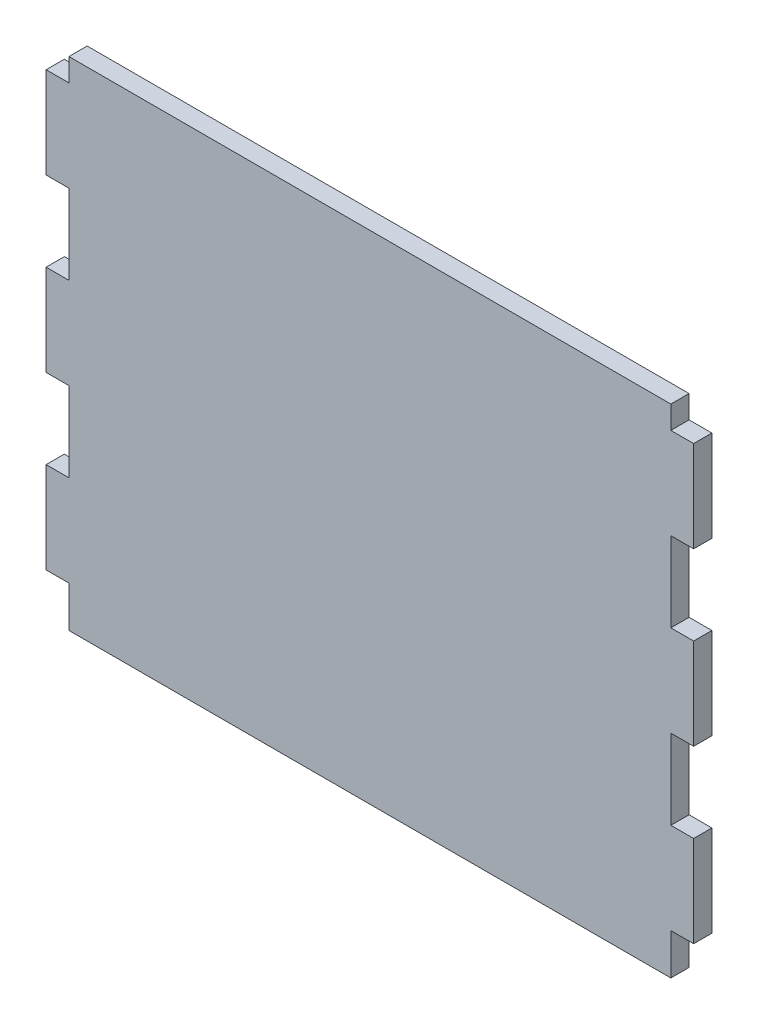
ISO-10303-21;
HEADER;
FILE_DESCRIPTION(('STEP AP214'),'2;1');
FILE_NAME('part.step','',(''),(''),'','','');
FILE_SCHEMA(('AUTOMOTIVE_DESIGN { 1 0 10303 214 1 1 1 1 }'));
ENDSEC;
DATA;
#1=APPLICATION_CONTEXT('core data for automotive mechanical design processes');
#2=APPLICATION_PROTOCOL_DEFINITION('international standard','automotive_design',2000,#1);
#3=PRODUCT_CONTEXT('',#1,'mechanical');
#4=PRODUCT('Part','Part','',(#3));
#5=PRODUCT_RELATED_PRODUCT_CATEGORY('part','',(#4));
#6=PRODUCT_DEFINITION_FORMATION('','',#4);
#7=PRODUCT_DEFINITION_CONTEXT('part definition',#1,'design');
#8=PRODUCT_DEFINITION('design','',#6,#7);
#9=PRODUCT_DEFINITION_SHAPE('','',#8);
#10=(LENGTH_UNIT() NAMED_UNIT(*) SI_UNIT(.MILLI.,.METRE.));
#11=(NAMED_UNIT(*) PLANE_ANGLE_UNIT() SI_UNIT($,.RADIAN.));
#12=(NAMED_UNIT(*) SI_UNIT($,.STERADIAN.) SOLID_ANGLE_UNIT());
#13=UNCERTAINTY_MEASURE_WITH_UNIT(LENGTH_MEASURE(1.E-05),#10,'distance_accuracy_value','');
#14=(GEOMETRIC_REPRESENTATION_CONTEXT(3) GLOBAL_UNCERTAINTY_ASSIGNED_CONTEXT((#13)) GLOBAL_UNIT_ASSIGNED_CONTEXT((#10,
#11,#12)) REPRESENTATION_CONTEXT('',''));
#15=CARTESIAN_POINT('',(0.,0.,0.));
#16=DIRECTION('',(0.,0.,1.));
#17=DIRECTION('',(1.,0.,0.));
#18=AXIS2_PLACEMENT_3D('',#15,#16,#17);
#19=CARTESIAN_POINT('',(-83.82,62.865,5.08));
#20=DIRECTION('',(1.,0.,0.));
#21=DIRECTION('',(0.,0.,-1.));
#22=AXIS2_PLACEMENT_3D('',#19,#20,#21);
#23=PLANE('',#22);
#24=DIRECTION('',(0.,-1.,0.));
#25=VECTOR('',#24,1.);
#26=CARTESIAN_POINT('',(-83.82,62.865,0.));
#27=LINE('',#26,#25);
#28=CARTESIAN_POINT('',(-83.82,69.215,0.));
#29=VERTEX_POINT('',#28);
#30=CARTESIAN_POINT('',(-83.82,62.865,0.));
#31=VERTEX_POINT('',#30);
#32=EDGE_CURVE('E260',#29,#31,#27,.T.);
#33=ORIENTED_EDGE('',*,*,#32,.T.);
#34=DIRECTION('',(0.,0.,-1.));
#35=VECTOR('',#34,1.);
#36=CARTESIAN_POINT('',(-83.82,62.865,5.08));
#37=LINE('',#36,#35);
#38=CARTESIAN_POINT('',(-83.82,62.865,5.08));
#39=VERTEX_POINT('',#38);
#40=EDGE_CURVE('E11',#39,#31,#37,.T.);
#41=ORIENTED_EDGE('',*,*,#40,.F.);
#42=DIRECTION('',(0.,-1.,0.));
#43=VECTOR('',#42,1.);
#44=CARTESIAN_POINT('',(-83.82,62.865,5.08));
#45=LINE('',#44,#43);
#46=CARTESIAN_POINT('',(-83.82,69.215,5.08));
#47=VERTEX_POINT('',#46);
#48=EDGE_CURVE('E342',#47,#39,#45,.T.);
#49=ORIENTED_EDGE('',*,*,#48,.F.);
#50=DIRECTION('',(0.,0.,-1.));
#51=VECTOR('',#50,1.);
#52=CARTESIAN_POINT('',(-83.82,69.215,5.08));
#53=LINE('',#52,#51);
#54=EDGE_CURVE('E256',#47,#29,#53,.T.);
#55=ORIENTED_EDGE('',*,*,#54,.T.);
#56=EDGE_LOOP('',(#33,#41,#49,#55));
#57=FACE_BOUND('',#56,.T.);
#58=ADVANCED_FACE('F39',(#57),#23,.F.);
#59=CARTESIAN_POINT('',(-83.82,62.865,5.08));
#60=DIRECTION('',(0.,-1.,0.));
#61=DIRECTION('',(0.,0.,-1.));
#62=AXIS2_PLACEMENT_3D('',#59,#60,#61);
#63=PLANE('',#62);
#64=DIRECTION('',(-1.,0.,0.));
#65=VECTOR('',#64,1.);
#66=CARTESIAN_POINT('',(-83.82,62.865,0.));
#67=LINE('',#66,#65);
#68=CARTESIAN_POINT('',(-90.17,62.865,0.));
#69=VERTEX_POINT('',#68);
#70=EDGE_CURVE('E264',#31,#69,#67,.T.);
#71=ORIENTED_EDGE('',*,*,#70,.T.);
#72=DIRECTION('',(0.,0.,-1.));
#73=VECTOR('',#72,1.);
#74=CARTESIAN_POINT('',(-90.17,62.865,5.08));
#75=LINE('',#74,#73);
#76=CARTESIAN_POINT('',(-90.17,62.865,5.08));
#77=VERTEX_POINT('',#76);
#78=EDGE_CURVE('E48',#77,#69,#75,.T.);
#79=ORIENTED_EDGE('',*,*,#78,.F.);
#80=DIRECTION('',(-1.,0.,0.));
#81=VECTOR('',#80,1.);
#82=CARTESIAN_POINT('',(-83.82,62.865,5.08));
#83=LINE('',#82,#81);
#84=EDGE_CURVE('E159',#39,#77,#83,.T.);
#85=ORIENTED_EDGE('',*,*,#84,.F.);
#86=ORIENTED_EDGE('',*,*,#40,.T.);
#87=EDGE_LOOP('',(#71,#79,#85,#86));
#88=FACE_BOUND('',#87,.T.);
#89=ADVANCED_FACE('F548',(#88),#63,.F.);
#90=CARTESIAN_POINT('',(-90.17,62.865,5.08));
#91=DIRECTION('',(1.,0.,0.));
#92=DIRECTION('',(0.,0.,-1.));
#93=AXIS2_PLACEMENT_3D('',#90,#91,#92);
#94=PLANE('',#93);
#95=DIRECTION('',(0.,-1.,0.));
#96=VECTOR('',#95,1.);
#97=CARTESIAN_POINT('',(-90.17,62.865,0.));
#98=LINE('',#97,#96);
#99=CARTESIAN_POINT('',(-90.17,37.4649999999999,0.));
#100=VERTEX_POINT('',#99);
#101=EDGE_CURVE('E267',#69,#100,#98,.T.);
#102=ORIENTED_EDGE('',*,*,#101,.T.);
#103=DIRECTION('',(0.,0.,-1.));
#104=VECTOR('',#103,1.);
#105=CARTESIAN_POINT('',(-90.17,37.4649999999999,5.08));
#106=LINE('',#105,#104);
#107=CARTESIAN_POINT('',(-90.17,37.4649999999999,5.08));
#108=VERTEX_POINT('',#107);
#109=EDGE_CURVE('E433',#108,#100,#106,.T.);
#110=ORIENTED_EDGE('',*,*,#109,.F.);
#111=DIRECTION('',(0.,-1.,0.));
#112=VECTOR('',#111,1.);
#113=CARTESIAN_POINT('',(-90.17,62.865,5.08));
#114=LINE('',#113,#112);
#115=EDGE_CURVE('E443',#77,#108,#114,.T.);
#116=ORIENTED_EDGE('',*,*,#115,.F.);
#117=ORIENTED_EDGE('',*,*,#78,.T.);
#118=EDGE_LOOP('',(#102,#110,#116,#117));
#119=FACE_BOUND('',#118,.T.);
#120=ADVANCED_FACE('F441',(#119),#94,.F.);
#121=CARTESIAN_POINT('',(-83.82,37.4649999999999,5.08));
#122=DIRECTION('',(0.,1.,0.));
#123=DIRECTION('',(0.,0.,1.));
#124=AXIS2_PLACEMENT_3D('',#121,#122,#123);
#125=PLANE('',#124);
#126=DIRECTION('',(1.,0.,0.));
#127=VECTOR('',#126,1.);
#128=CARTESIAN_POINT('',(-83.82,37.4649999999999,0.));
#129=LINE('',#128,#127);
#130=CARTESIAN_POINT('',(-83.82,37.4649999999999,0.));
#131=VERTEX_POINT('',#130);
#132=EDGE_CURVE('E270',#100,#131,#129,.T.);
#133=ORIENTED_EDGE('',*,*,#132,.T.);
#134=DIRECTION('',(0.,0.,-1.));
#135=VECTOR('',#134,1.);
#136=CARTESIAN_POINT('',(-83.82,37.4649999999999,5.08));
#137=LINE('',#136,#135);
#138=CARTESIAN_POINT('',(-83.82,37.4649999999999,5.08));
#139=VERTEX_POINT('',#138);
#140=EDGE_CURVE('E429',#139,#131,#137,.T.);
#141=ORIENTED_EDGE('',*,*,#140,.F.);
#142=DIRECTION('',(1.,0.,0.));
#143=VECTOR('',#142,1.);
#144=CARTESIAN_POINT('',(-83.82,37.4649999999999,5.08));
#145=LINE('',#144,#143);
#146=EDGE_CURVE('E462',#108,#139,#145,.T.);
#147=ORIENTED_EDGE('',*,*,#146,.F.);
#148=ORIENTED_EDGE('',*,*,#109,.T.);
#149=EDGE_LOOP('',(#133,#141,#147,#148));
#150=FACE_BOUND('',#149,.T.);
#151=ADVANCED_FACE('F452',(#150),#125,.F.);
#152=CARTESIAN_POINT('',(-83.82,15.24,5.08));
#153=DIRECTION('',(1.,0.,0.));
#154=DIRECTION('',(0.,0.,-1.));
#155=AXIS2_PLACEMENT_3D('',#152,#153,#154);
#156=PLANE('',#155);
#157=DIRECTION('',(0.,-1.,0.));
#158=VECTOR('',#157,1.);
#159=CARTESIAN_POINT('',(-83.82,15.24,0.));
#160=LINE('',#159,#158);
#161=CARTESIAN_POINT('',(-83.82,15.24,0.));
#162=VERTEX_POINT('',#161);
#163=EDGE_CURVE('E273',#131,#162,#160,.T.);
#164=ORIENTED_EDGE('',*,*,#163,.T.);
#165=DIRECTION('',(0.,0.,-1.));
#166=VECTOR('',#165,1.);
#167=CARTESIAN_POINT('',(-83.82,15.24,5.08));
#168=LINE('',#167,#166);
#169=CARTESIAN_POINT('',(-83.82,15.24,5.08));
#170=VERTEX_POINT('',#169);
#171=EDGE_CURVE('E425',#170,#162,#168,.T.);
#172=ORIENTED_EDGE('',*,*,#171,.F.);
#173=DIRECTION('',(0.,-1.,0.));
#174=VECTOR('',#173,1.);
#175=CARTESIAN_POINT('',(-83.82,15.24,5.08));
#176=LINE('',#175,#174);
#177=EDGE_CURVE('E458',#139,#170,#176,.T.);
#178=ORIENTED_EDGE('',*,*,#177,.F.);
#179=ORIENTED_EDGE('',*,*,#140,.T.);
#180=EDGE_LOOP('',(#164,#172,#178,#179));
#181=FACE_BOUND('',#180,.T.);
#182=ADVANCED_FACE('F456',(#181),#156,.F.);
#183=CARTESIAN_POINT('',(-83.82,15.24,5.08));
#184=DIRECTION('',(0.,-1.,0.));
#185=DIRECTION('',(1.,0.,0.));
#186=AXIS2_PLACEMENT_3D('',#183,#184,#185);
#187=PLANE('',#186);
#188=DIRECTION('',(-1.,0.,0.));
#189=VECTOR('',#188,1.);
#190=CARTESIAN_POINT('',(-83.82,15.24,0.));
#191=LINE('',#190,#189);
#192=CARTESIAN_POINT('',(-90.17,15.24,0.));
#193=VERTEX_POINT('',#192);
#194=EDGE_CURVE('E276',#162,#193,#191,.T.);
#195=ORIENTED_EDGE('',*,*,#194,.T.);
#196=DIRECTION('',(0.,0.,-1.));
#197=VECTOR('',#196,1.);
#198=CARTESIAN_POINT('',(-90.17,15.24,5.08));
#199=LINE('',#198,#197);
#200=CARTESIAN_POINT('',(-90.17,15.24,5.08));
#201=VERTEX_POINT('',#200);
#202=EDGE_CURVE('E421',#201,#193,#199,.T.);
#203=ORIENTED_EDGE('',*,*,#202,.F.);
#204=DIRECTION('',(-1.,0.,0.));
#205=VECTOR('',#204,1.);
#206=CARTESIAN_POINT('',(-83.82,15.24,5.08));
#207=LINE('',#206,#205);
#208=EDGE_CURVE('E461',#170,#201,#207,.T.);
#209=ORIENTED_EDGE('',*,*,#208,.F.);
#210=ORIENTED_EDGE('',*,*,#171,.T.);
#211=EDGE_LOOP('',(#195,#203,#209,#210));
#212=FACE_BOUND('',#211,.T.);
#213=ADVANCED_FACE('F561',(#212),#187,.F.);
#214=CARTESIAN_POINT('',(-90.17,15.24,5.08));
#215=DIRECTION('',(1.,0.,0.));
#216=DIRECTION('',(0.,1.,0.));
#217=AXIS2_PLACEMENT_3D('',#214,#215,#216);
#218=PLANE('',#217);
#219=DIRECTION('',(0.,-1.,0.));
#220=VECTOR('',#219,1.);
#221=CARTESIAN_POINT('',(-90.17,15.24,0.));
#222=LINE('',#221,#220);
#223=CARTESIAN_POINT('',(-90.17,-10.16,0.));
#224=VERTEX_POINT('',#223);
#225=EDGE_CURVE('E279',#193,#224,#222,.T.);
#226=ORIENTED_EDGE('',*,*,#225,.T.);
#227=DIRECTION('',(0.,0.,-1.));
#228=VECTOR('',#227,1.);
#229=CARTESIAN_POINT('',(-90.17,-10.16,5.08));
#230=LINE('',#229,#228);
#231=CARTESIAN_POINT('',(-90.17,-10.16,5.08));
#232=VERTEX_POINT('',#231);
#233=EDGE_CURVE('E417',#232,#224,#230,.T.);
#234=ORIENTED_EDGE('',*,*,#233,.F.);
#235=DIRECTION('',(0.,-1.,0.));
#236=VECTOR('',#235,1.);
#237=CARTESIAN_POINT('',(-90.17,15.24,5.08));
#238=LINE('',#237,#236);
#239=EDGE_CURVE('E466',#201,#232,#238,.T.);
#240=ORIENTED_EDGE('',*,*,#239,.F.);
#241=ORIENTED_EDGE('',*,*,#202,.T.);
#242=EDGE_LOOP('',(#226,#234,#240,#241));
#243=FACE_BOUND('',#242,.T.);
#244=ADVANCED_FACE('F564',(#243),#218,.F.);
#245=CARTESIAN_POINT('',(-83.82,-10.16,5.08));
#246=DIRECTION('',(0.,1.,0.));
#247=DIRECTION('',(-1.,0.,0.));
#248=AXIS2_PLACEMENT_3D('',#245,#246,#247);
#249=PLANE('',#248);
#250=DIRECTION('',(1.,0.,0.));
#251=VECTOR('',#250,1.);
#252=CARTESIAN_POINT('',(-83.82,-10.16,0.));
#253=LINE('',#252,#251);
#254=CARTESIAN_POINT('',(-83.82,-10.16,0.));
#255=VERTEX_POINT('',#254);
#256=EDGE_CURVE('E282',#224,#255,#253,.T.);
#257=ORIENTED_EDGE('',*,*,#256,.T.);
#258=DIRECTION('',(0.,0.,-1.));
#259=VECTOR('',#258,1.);
#260=CARTESIAN_POINT('',(-83.82,-10.16,5.08));
#261=LINE('',#260,#259);
#262=CARTESIAN_POINT('',(-83.82,-10.16,5.08));
#263=VERTEX_POINT('',#262);
#264=EDGE_CURVE('E413',#263,#255,#261,.T.);
#265=ORIENTED_EDGE('',*,*,#264,.F.);
#266=DIRECTION('',(1.,0.,0.));
#267=VECTOR('',#266,1.);
#268=CARTESIAN_POINT('',(-83.82,-10.16,5.08));
#269=LINE('',#268,#267);
#270=EDGE_CURVE('E473',#232,#263,#269,.T.);
#271=ORIENTED_EDGE('',*,*,#270,.F.);
#272=ORIENTED_EDGE('',*,*,#233,.T.);
#273=EDGE_LOOP('',(#257,#265,#271,#272));
#274=FACE_BOUND('',#273,.T.);
#275=ADVANCED_FACE('F568',(#274),#249,.F.);
#276=CARTESIAN_POINT('',(-83.82,-32.385,5.08));
#277=DIRECTION('',(1.,0.,0.));
#278=DIRECTION('',(0.,0.,-1.));
#279=AXIS2_PLACEMENT_3D('',#276,#277,#278);
#280=PLANE('',#279);
#281=DIRECTION('',(0.,-1.,0.));
#282=VECTOR('',#281,1.);
#283=CARTESIAN_POINT('',(-83.82,-32.385,0.));
#284=LINE('',#283,#282);
#285=CARTESIAN_POINT('',(-83.82,-32.385,0.));
#286=VERTEX_POINT('',#285);
#287=EDGE_CURVE('E285',#255,#286,#284,.T.);
#288=ORIENTED_EDGE('',*,*,#287,.T.);
#289=DIRECTION('',(0.,0.,-1.));
#290=VECTOR('',#289,1.);
#291=CARTESIAN_POINT('',(-83.82,-32.385,5.08));
#292=LINE('',#291,#290);
#293=CARTESIAN_POINT('',(-83.82,-32.385,5.08));
#294=VERTEX_POINT('',#293);
#295=EDGE_CURVE('E409',#294,#286,#292,.T.);
#296=ORIENTED_EDGE('',*,*,#295,.F.);
#297=DIRECTION('',(0.,-1.,0.));
#298=VECTOR('',#297,1.);
#299=CARTESIAN_POINT('',(-83.82,-32.385,5.08));
#300=LINE('',#299,#298);
#301=EDGE_CURVE('E476',#263,#294,#300,.T.);
#302=ORIENTED_EDGE('',*,*,#301,.F.);
#303=ORIENTED_EDGE('',*,*,#264,.T.);
#304=EDGE_LOOP('',(#288,#296,#302,#303));
#305=FACE_BOUND('',#304,.T.);
#306=ADVANCED_FACE('F572',(#305),#280,.F.);
#307=CARTESIAN_POINT('',(-83.82,-32.385,5.08));
#308=DIRECTION('',(0.,-1.,0.));
#309=DIRECTION('',(0.,0.,-1.));
#310=AXIS2_PLACEMENT_3D('',#307,#308,#309);
#311=PLANE('',#310);
#312=DIRECTION('',(-1.,0.,0.));
#313=VECTOR('',#312,1.);
#314=CARTESIAN_POINT('',(-83.82,-32.385,0.));
#315=LINE('',#314,#313);
#316=CARTESIAN_POINT('',(-90.17,-32.385,0.));
#317=VERTEX_POINT('',#316);
#318=EDGE_CURVE('E288',#286,#317,#315,.T.);
#319=ORIENTED_EDGE('',*,*,#318,.T.);
#320=DIRECTION('',(0.,0.,-1.));
#321=VECTOR('',#320,1.);
#322=CARTESIAN_POINT('',(-90.17,-32.385,5.08));
#323=LINE('',#322,#321);
#324=CARTESIAN_POINT('',(-90.17,-32.385,5.08));
#325=VERTEX_POINT('',#324);
#326=EDGE_CURVE('E405',#325,#317,#323,.T.);
#327=ORIENTED_EDGE('',*,*,#326,.F.);
#328=DIRECTION('',(-1.,0.,0.));
#329=VECTOR('',#328,1.);
#330=CARTESIAN_POINT('',(-83.82,-32.385,5.08));
#331=LINE('',#330,#329);
#332=EDGE_CURVE('E479',#294,#325,#331,.T.);
#333=ORIENTED_EDGE('',*,*,#332,.F.);
#334=ORIENTED_EDGE('',*,*,#295,.T.);
#335=EDGE_LOOP('',(#319,#327,#333,#334));
#336=FACE_BOUND('',#335,.T.);
#337=ADVANCED_FACE('F576',(#336),#311,.F.);
#338=CARTESIAN_POINT('',(-90.17,-32.385,5.08));
#339=DIRECTION('',(1.,0.,0.));
#340=DIRECTION('',(0.,1.,0.));
#341=AXIS2_PLACEMENT_3D('',#338,#339,#340);
#342=PLANE('',#341);
#343=DIRECTION('',(0.,-1.,0.));
#344=VECTOR('',#343,1.);
#345=CARTESIAN_POINT('',(-90.17,-32.385,0.));
#346=LINE('',#345,#344);
#347=CARTESIAN_POINT('',(-90.17,-57.785,0.));
#348=VERTEX_POINT('',#347);
#349=EDGE_CURVE('E291',#317,#348,#346,.T.);
#350=ORIENTED_EDGE('',*,*,#349,.T.);
#351=DIRECTION('',(0.,0.,-1.));
#352=VECTOR('',#351,1.);
#353=CARTESIAN_POINT('',(-90.17,-57.785,5.08));
#354=LINE('',#353,#352);
#355=CARTESIAN_POINT('',(-90.17,-57.785,5.08));
#356=VERTEX_POINT('',#355);
#357=EDGE_CURVE('E401',#356,#348,#354,.T.);
#358=ORIENTED_EDGE('',*,*,#357,.F.);
#359=DIRECTION('',(0.,-1.,0.));
#360=VECTOR('',#359,1.);
#361=CARTESIAN_POINT('',(-90.17,-32.385,5.08));
#362=LINE('',#361,#360);
#363=EDGE_CURVE('E482',#325,#356,#362,.T.);
#364=ORIENTED_EDGE('',*,*,#363,.F.);
#365=ORIENTED_EDGE('',*,*,#326,.T.);
#366=EDGE_LOOP('',(#350,#358,#364,#365));
#367=FACE_BOUND('',#366,.T.);
#368=ADVANCED_FACE('F580',(#367),#342,.F.);
#369=CARTESIAN_POINT('',(-83.82,-57.785,5.08));
#370=DIRECTION('',(0.,1.,0.));
#371=DIRECTION('',(-1.,0.,0.));
#372=AXIS2_PLACEMENT_3D('',#369,#370,#371);
#373=PLANE('',#372);
#374=DIRECTION('',(1.,0.,0.));
#375=VECTOR('',#374,1.);
#376=CARTESIAN_POINT('',(-83.82,-57.785,0.));
#377=LINE('',#376,#375);
#378=CARTESIAN_POINT('',(-83.82,-57.785,0.));
#379=VERTEX_POINT('',#378);
#380=EDGE_CURVE('E294',#348,#379,#377,.T.);
#381=ORIENTED_EDGE('',*,*,#380,.T.);
#382=DIRECTION('',(0.,0.,-1.));
#383=VECTOR('',#382,1.);
#384=CARTESIAN_POINT('',(-83.82,-57.785,5.08));
#385=LINE('',#384,#383);
#386=CARTESIAN_POINT('',(-83.82,-57.785,5.08));
#387=VERTEX_POINT('',#386);
#388=EDGE_CURVE('E397',#387,#379,#385,.T.);
#389=ORIENTED_EDGE('',*,*,#388,.F.);
#390=DIRECTION('',(1.,0.,0.));
#391=VECTOR('',#390,1.);
#392=CARTESIAN_POINT('',(-83.82,-57.785,5.08));
#393=LINE('',#392,#391);
#394=EDGE_CURVE('E485',#356,#387,#393,.T.);
#395=ORIENTED_EDGE('',*,*,#394,.F.);
#396=ORIENTED_EDGE('',*,*,#357,.T.);
#397=EDGE_LOOP('',(#381,#389,#395,#396));
#398=FACE_BOUND('',#397,.T.);
#399=ADVANCED_FACE('F584',(#398),#373,.F.);
#400=CARTESIAN_POINT('',(-83.82,-69.215,5.08));
#401=DIRECTION('',(1.,0.,0.));
#402=DIRECTION('',(0.,0.,-1.));
#403=AXIS2_PLACEMENT_3D('',#400,#401,#402);
#404=PLANE('',#403);
#405=DIRECTION('',(0.,-1.,0.));
#406=VECTOR('',#405,1.);
#407=CARTESIAN_POINT('',(-83.82,-69.215,0.));
#408=LINE('',#407,#406);
#409=CARTESIAN_POINT('',(-83.82,-69.215,0.));
#410=VERTEX_POINT('',#409);
#411=EDGE_CURVE('E297',#379,#410,#408,.T.);
#412=ORIENTED_EDGE('',*,*,#411,.T.);
#413=DIRECTION('',(0.,0.,-1.));
#414=VECTOR('',#413,1.);
#415=CARTESIAN_POINT('',(-83.82,-69.215,5.08));
#416=LINE('',#415,#414);
#417=CARTESIAN_POINT('',(-83.82,-69.215,5.08));
#418=VERTEX_POINT('',#417);
#419=EDGE_CURVE('E393',#418,#410,#416,.T.);
#420=ORIENTED_EDGE('',*,*,#419,.F.);
#421=DIRECTION('',(0.,-1.,0.));
#422=VECTOR('',#421,1.);
#423=CARTESIAN_POINT('',(-83.82,-69.215,5.08));
#424=LINE('',#423,#422);
#425=EDGE_CURVE('E488',#387,#418,#424,.T.);
#426=ORIENTED_EDGE('',*,*,#425,.F.);
#427=ORIENTED_EDGE('',*,*,#388,.T.);
#428=EDGE_LOOP('',(#412,#420,#426,#427));
#429=FACE_BOUND('',#428,.T.);
#430=ADVANCED_FACE('F588',(#429),#404,.F.);
#431=CARTESIAN_POINT('',(83.82,-69.215,5.08));
#432=DIRECTION('',(0.,1.,0.));
#433=DIRECTION('',(-1.,0.,0.));
#434=AXIS2_PLACEMENT_3D('',#431,#432,#433);
#435=PLANE('',#434);
#436=DIRECTION('',(1.,0.,0.));
#437=VECTOR('',#436,1.);
#438=CARTESIAN_POINT('',(83.82,-69.215,0.));
#439=LINE('',#438,#437);
#440=CARTESIAN_POINT('',(83.82,-69.215,0.));
#441=VERTEX_POINT('',#440);
#442=EDGE_CURVE('E300',#410,#441,#439,.T.);
#443=ORIENTED_EDGE('',*,*,#442,.T.);
#444=DIRECTION('',(0.,0.,-1.));
#445=VECTOR('',#444,1.);
#446=CARTESIAN_POINT('',(83.82,-69.215,5.08));
#447=LINE('',#446,#445);
#448=CARTESIAN_POINT('',(83.82,-69.215,5.08));
#449=VERTEX_POINT('',#448);
#450=EDGE_CURVE('E389',#449,#441,#447,.T.);
#451=ORIENTED_EDGE('',*,*,#450,.F.);
#452=DIRECTION('',(1.,0.,0.));
#453=VECTOR('',#452,1.);
#454=CARTESIAN_POINT('',(83.82,-69.215,5.08));
#455=LINE('',#454,#453);
#456=EDGE_CURVE('E491',#418,#449,#455,.T.);
#457=ORIENTED_EDGE('',*,*,#456,.F.);
#458=ORIENTED_EDGE('',*,*,#419,.T.);
#459=EDGE_LOOP('',(#443,#451,#457,#458));
#460=FACE_BOUND('',#459,.T.);
#461=ADVANCED_FACE('F592',(#460),#435,.F.);
#462=CARTESIAN_POINT('',(83.82,-69.215,5.08));
#463=DIRECTION('',(-1.,0.,0.));
#464=DIRECTION('',(0.,0.,1.));
#465=AXIS2_PLACEMENT_3D('',#462,#463,#464);
#466=PLANE('',#465);
#467=DIRECTION('',(0.,1.,0.));
#468=VECTOR('',#467,1.);
#469=CARTESIAN_POINT('',(83.82,-69.215,0.));
#470=LINE('',#469,#468);
#471=CARTESIAN_POINT('',(83.82,-57.785,0.));
#472=VERTEX_POINT('',#471);
#473=EDGE_CURVE('E303',#441,#472,#470,.T.);
#474=ORIENTED_EDGE('',*,*,#473,.T.);
#475=DIRECTION('',(0.,0.,-1.));
#476=VECTOR('',#475,1.);
#477=CARTESIAN_POINT('',(83.82,-57.785,5.08));
#478=LINE('',#477,#476);
#479=CARTESIAN_POINT('',(83.82,-57.785,5.08));
#480=VERTEX_POINT('',#479);
#481=EDGE_CURVE('E385',#480,#472,#478,.T.);
#482=ORIENTED_EDGE('',*,*,#481,.F.);
#483=DIRECTION('',(0.,1.,0.));
#484=VECTOR('',#483,1.);
#485=CARTESIAN_POINT('',(83.82,-69.215,5.08));
#486=LINE('',#485,#484);
#487=EDGE_CURVE('E494',#449,#480,#486,.T.);
#488=ORIENTED_EDGE('',*,*,#487,.F.);
#489=ORIENTED_EDGE('',*,*,#450,.T.);
#490=EDGE_LOOP('',(#474,#482,#488,#489));
#491=FACE_BOUND('',#490,.T.);
#492=ADVANCED_FACE('F596',(#491),#466,.F.);
#493=CARTESIAN_POINT('',(83.82,-57.785,5.08));
#494=DIRECTION('',(0.,1.,0.));
#495=DIRECTION('',(-1.,0.,0.));
#496=AXIS2_PLACEMENT_3D('',#493,#494,#495);
#497=PLANE('',#496);
#498=DIRECTION('',(1.,0.,0.));
#499=VECTOR('',#498,1.);
#500=CARTESIAN_POINT('',(83.82,-57.785,0.));
#501=LINE('',#500,#499);
#502=CARTESIAN_POINT('',(90.17,-57.785,0.));
#503=VERTEX_POINT('',#502);
#504=EDGE_CURVE('E306',#472,#503,#501,.T.);
#505=ORIENTED_EDGE('',*,*,#504,.T.);
#506=DIRECTION('',(0.,0.,-1.));
#507=VECTOR('',#506,1.);
#508=CARTESIAN_POINT('',(90.17,-57.785,5.08));
#509=LINE('',#508,#507);
#510=CARTESIAN_POINT('',(90.17,-57.785,5.08));
#511=VERTEX_POINT('',#510);
#512=EDGE_CURVE('E381',#511,#503,#509,.T.);
#513=ORIENTED_EDGE('',*,*,#512,.F.);
#514=DIRECTION('',(1.,0.,0.));
#515=VECTOR('',#514,1.);
#516=CARTESIAN_POINT('',(83.82,-57.785,5.08));
#517=LINE('',#516,#515);
#518=EDGE_CURVE('E497',#480,#511,#517,.T.);
#519=ORIENTED_EDGE('',*,*,#518,.F.);
#520=ORIENTED_EDGE('',*,*,#481,.T.);
#521=EDGE_LOOP('',(#505,#513,#519,#520));
#522=FACE_BOUND('',#521,.T.);
#523=ADVANCED_FACE('F600',(#522),#497,.F.);
#524=CARTESIAN_POINT('',(90.17,-32.385,5.08));
#525=DIRECTION('',(-1.,0.,0.));
#526=DIRECTION('',(0.,-1.,0.));
#527=AXIS2_PLACEMENT_3D('',#524,#525,#526);
#528=PLANE('',#527);
#529=DIRECTION('',(0.,1.,0.));
#530=VECTOR('',#529,1.);
#531=CARTESIAN_POINT('',(90.17,-32.385,0.));
#532=LINE('',#531,#530);
#533=CARTESIAN_POINT('',(90.17,-32.385,0.));
#534=VERTEX_POINT('',#533);
#535=EDGE_CURVE('E309',#503,#534,#532,.T.);
#536=ORIENTED_EDGE('',*,*,#535,.T.);
#537=DIRECTION('',(0.,0.,-1.));
#538=VECTOR('',#537,1.);
#539=CARTESIAN_POINT('',(90.17,-32.385,5.08));
#540=LINE('',#539,#538);
#541=CARTESIAN_POINT('',(90.17,-32.385,5.08));
#542=VERTEX_POINT('',#541);
#543=EDGE_CURVE('E377',#542,#534,#540,.T.);
#544=ORIENTED_EDGE('',*,*,#543,.F.);
#545=DIRECTION('',(0.,1.,0.));
#546=VECTOR('',#545,1.);
#547=CARTESIAN_POINT('',(90.17,-32.385,5.08));
#548=LINE('',#547,#546);
#549=EDGE_CURVE('E500',#511,#542,#548,.T.);
#550=ORIENTED_EDGE('',*,*,#549,.F.);
#551=ORIENTED_EDGE('',*,*,#512,.T.);
#552=EDGE_LOOP('',(#536,#544,#550,#551));
#553=FACE_BOUND('',#552,.T.);
#554=ADVANCED_FACE('F604',(#553),#528,.F.);
#555=CARTESIAN_POINT('',(83.82,-32.385,5.08));
#556=DIRECTION('',(0.,-1.,0.));
#557=DIRECTION('',(0.,0.,-1.));
#558=AXIS2_PLACEMENT_3D('',#555,#556,#557);
#559=PLANE('',#558);
#560=DIRECTION('',(-1.,0.,0.));
#561=VECTOR('',#560,1.);
#562=CARTESIAN_POINT('',(83.82,-32.385,0.));
#563=LINE('',#562,#561);
#564=CARTESIAN_POINT('',(83.82,-32.385,0.));
#565=VERTEX_POINT('',#564);
#566=EDGE_CURVE('E312',#534,#565,#563,.T.);
#567=ORIENTED_EDGE('',*,*,#566,.T.);
#568=DIRECTION('',(0.,0.,-1.));
#569=VECTOR('',#568,1.);
#570=CARTESIAN_POINT('',(83.82,-32.385,5.08));
#571=LINE('',#570,#569);
#572=CARTESIAN_POINT('',(83.82,-32.385,5.08));
#573=VERTEX_POINT('',#572);
#574=EDGE_CURVE('E373',#573,#565,#571,.T.);
#575=ORIENTED_EDGE('',*,*,#574,.F.);
#576=DIRECTION('',(-1.,0.,0.));
#577=VECTOR('',#576,1.);
#578=CARTESIAN_POINT('',(83.82,-32.385,5.08));
#579=LINE('',#578,#577);
#580=EDGE_CURVE('E503',#542,#573,#579,.T.);
#581=ORIENTED_EDGE('',*,*,#580,.F.);
#582=ORIENTED_EDGE('',*,*,#543,.T.);
#583=EDGE_LOOP('',(#567,#575,#581,#582));
#584=FACE_BOUND('',#583,.T.);
#585=ADVANCED_FACE('F608',(#584),#559,.F.);
#586=CARTESIAN_POINT('',(83.82,-32.385,5.08));
#587=DIRECTION('',(-1.,0.,0.));
#588=DIRECTION('',(0.,0.,1.));
#589=AXIS2_PLACEMENT_3D('',#586,#587,#588);
#590=PLANE('',#589);
#591=DIRECTION('',(0.,1.,0.));
#592=VECTOR('',#591,1.);
#593=CARTESIAN_POINT('',(83.82,-32.385,0.));
#594=LINE('',#593,#592);
#595=CARTESIAN_POINT('',(83.82,-10.16,0.));
#596=VERTEX_POINT('',#595);
#597=EDGE_CURVE('E315',#565,#596,#594,.T.);
#598=ORIENTED_EDGE('',*,*,#597,.T.);
#599=DIRECTION('',(0.,0.,-1.));
#600=VECTOR('',#599,1.);
#601=CARTESIAN_POINT('',(83.82,-10.16,5.08));
#602=LINE('',#601,#600);
#603=CARTESIAN_POINT('',(83.82,-10.16,5.08));
#604=VERTEX_POINT('',#603);
#605=EDGE_CURVE('E369',#604,#596,#602,.T.);
#606=ORIENTED_EDGE('',*,*,#605,.F.);
#607=DIRECTION('',(0.,1.,0.));
#608=VECTOR('',#607,1.);
#609=CARTESIAN_POINT('',(83.82,-32.385,5.08));
#610=LINE('',#609,#608);
#611=EDGE_CURVE('E506',#573,#604,#610,.T.);
#612=ORIENTED_EDGE('',*,*,#611,.F.);
#613=ORIENTED_EDGE('',*,*,#574,.T.);
#614=EDGE_LOOP('',(#598,#606,#612,#613));
#615=FACE_BOUND('',#614,.T.);
#616=ADVANCED_FACE('F612',(#615),#590,.F.);
#617=CARTESIAN_POINT('',(83.82,-10.16,5.08));
#618=DIRECTION('',(0.,1.,0.));
#619=DIRECTION('',(0.,0.,1.));
#620=AXIS2_PLACEMENT_3D('',#617,#618,#619);
#621=PLANE('',#620);
#622=DIRECTION('',(1.,0.,0.));
#623=VECTOR('',#622,1.);
#624=CARTESIAN_POINT('',(83.82,-10.16,0.));
#625=LINE('',#624,#623);
#626=CARTESIAN_POINT('',(90.17,-10.16,0.));
#627=VERTEX_POINT('',#626);
#628=EDGE_CURVE('E318',#596,#627,#625,.T.);
#629=ORIENTED_EDGE('',*,*,#628,.T.);
#630=DIRECTION('',(0.,0.,-1.));
#631=VECTOR('',#630,1.);
#632=CARTESIAN_POINT('',(90.17,-10.16,5.08));
#633=LINE('',#632,#631);
#634=CARTESIAN_POINT('',(90.17,-10.16,5.08));
#635=VERTEX_POINT('',#634);
#636=EDGE_CURVE('E365',#635,#627,#633,.T.);
#637=ORIENTED_EDGE('',*,*,#636,.F.);
#638=DIRECTION('',(1.,0.,0.));
#639=VECTOR('',#638,1.);
#640=CARTESIAN_POINT('',(83.82,-10.16,5.08));
#641=LINE('',#640,#639);
#642=EDGE_CURVE('E509',#604,#635,#641,.T.);
#643=ORIENTED_EDGE('',*,*,#642,.F.);
#644=ORIENTED_EDGE('',*,*,#605,.T.);
#645=EDGE_LOOP('',(#629,#637,#643,#644));
#646=FACE_BOUND('',#645,.T.);
#647=ADVANCED_FACE('F616',(#646),#621,.F.);
#648=CARTESIAN_POINT('',(90.17,15.24,5.08));
#649=DIRECTION('',(-1.,0.,0.));
#650=DIRECTION('',(0.,-1.,0.));
#651=AXIS2_PLACEMENT_3D('',#648,#649,#650);
#652=PLANE('',#651);
#653=DIRECTION('',(0.,1.,0.));
#654=VECTOR('',#653,1.);
#655=CARTESIAN_POINT('',(90.17,15.24,0.));
#656=LINE('',#655,#654);
#657=CARTESIAN_POINT('',(90.17,15.24,0.));
#658=VERTEX_POINT('',#657);
#659=EDGE_CURVE('E321',#627,#658,#656,.T.);
#660=ORIENTED_EDGE('',*,*,#659,.T.);
#661=DIRECTION('',(0.,0.,-1.));
#662=VECTOR('',#661,1.);
#663=CARTESIAN_POINT('',(90.17,15.24,5.08));
#664=LINE('',#663,#662);
#665=CARTESIAN_POINT('',(90.17,15.24,5.08));
#666=VERTEX_POINT('',#665);
#667=EDGE_CURVE('E361',#666,#658,#664,.T.);
#668=ORIENTED_EDGE('',*,*,#667,.F.);
#669=DIRECTION('',(0.,1.,0.));
#670=VECTOR('',#669,1.);
#671=CARTESIAN_POINT('',(90.17,15.24,5.08));
#672=LINE('',#671,#670);
#673=EDGE_CURVE('E512',#635,#666,#672,.T.);
#674=ORIENTED_EDGE('',*,*,#673,.F.);
#675=ORIENTED_EDGE('',*,*,#636,.T.);
#676=EDGE_LOOP('',(#660,#668,#674,#675));
#677=FACE_BOUND('',#676,.T.);
#678=ADVANCED_FACE('F620',(#677),#652,.F.);
#679=CARTESIAN_POINT('',(83.82,15.24,5.08));
#680=DIRECTION('',(0.,-1.,0.));
#681=DIRECTION('',(0.,0.,-1.));
#682=AXIS2_PLACEMENT_3D('',#679,#680,#681);
#683=PLANE('',#682);
#684=DIRECTION('',(-1.,0.,0.));
#685=VECTOR('',#684,1.);
#686=CARTESIAN_POINT('',(83.82,15.24,0.));
#687=LINE('',#686,#685);
#688=CARTESIAN_POINT('',(83.82,15.24,0.));
#689=VERTEX_POINT('',#688);
#690=EDGE_CURVE('E324',#658,#689,#687,.T.);
#691=ORIENTED_EDGE('',*,*,#690,.T.);
#692=DIRECTION('',(0.,0.,-1.));
#693=VECTOR('',#692,1.);
#694=CARTESIAN_POINT('',(83.82,15.24,5.08));
#695=LINE('',#694,#693);
#696=CARTESIAN_POINT('',(83.82,15.24,5.08));
#697=VERTEX_POINT('',#696);
#698=EDGE_CURVE('E357',#697,#689,#695,.T.);
#699=ORIENTED_EDGE('',*,*,#698,.F.);
#700=DIRECTION('',(-1.,0.,0.));
#701=VECTOR('',#700,1.);
#702=CARTESIAN_POINT('',(83.82,15.24,5.08));
#703=LINE('',#702,#701);
#704=EDGE_CURVE('E515',#666,#697,#703,.T.);
#705=ORIENTED_EDGE('',*,*,#704,.F.);
#706=ORIENTED_EDGE('',*,*,#667,.T.);
#707=EDGE_LOOP('',(#691,#699,#705,#706));
#708=FACE_BOUND('',#707,.T.);
#709=ADVANCED_FACE('F624',(#708),#683,.F.);
#710=CARTESIAN_POINT('',(83.82,15.24,5.08));
#711=DIRECTION('',(-1.,0.,0.));
#712=DIRECTION('',(0.,-1.,0.));
#713=AXIS2_PLACEMENT_3D('',#710,#711,#712);
#714=PLANE('',#713);
#715=DIRECTION('',(0.,1.,0.));
#716=VECTOR('',#715,1.);
#717=CARTESIAN_POINT('',(83.82,15.24,0.));
#718=LINE('',#717,#716);
#719=CARTESIAN_POINT('',(83.82,37.4649999999999,0.));
#720=VERTEX_POINT('',#719);
#721=EDGE_CURVE('E327',#689,#720,#718,.T.);
#722=ORIENTED_EDGE('',*,*,#721,.T.);
#723=DIRECTION('',(0.,0.,-1.));
#724=VECTOR('',#723,1.);
#725=CARTESIAN_POINT('',(83.82,37.4649999999999,5.08));
#726=LINE('',#725,#724);
#727=CARTESIAN_POINT('',(83.82,37.4649999999999,5.08));
#728=VERTEX_POINT('',#727);
#729=EDGE_CURVE('E353',#728,#720,#726,.T.);
#730=ORIENTED_EDGE('',*,*,#729,.F.);
#731=DIRECTION('',(0.,1.,0.));
#732=VECTOR('',#731,1.);
#733=CARTESIAN_POINT('',(83.82,15.24,5.08));
#734=LINE('',#733,#732);
#735=EDGE_CURVE('E518',#697,#728,#734,.T.);
#736=ORIENTED_EDGE('',*,*,#735,.F.);
#737=ORIENTED_EDGE('',*,*,#698,.T.);
#738=EDGE_LOOP('',(#722,#730,#736,#737));
#739=FACE_BOUND('',#738,.T.);
#740=ADVANCED_FACE('F628',(#739),#714,.F.);
#741=CARTESIAN_POINT('',(83.82,37.4649999999999,5.08));
#742=DIRECTION('',(0.,1.,0.));
#743=DIRECTION('',(0.,0.,1.));
#744=AXIS2_PLACEMENT_3D('',#741,#742,#743);
#745=PLANE('',#744);
#746=DIRECTION('',(1.,0.,0.));
#747=VECTOR('',#746,1.);
#748=CARTESIAN_POINT('',(83.82,37.4649999999999,0.));
#749=LINE('',#748,#747);
#750=CARTESIAN_POINT('',(90.17,37.4649999999999,0.));
#751=VERTEX_POINT('',#750);
#752=EDGE_CURVE('E330',#720,#751,#749,.T.);
#753=ORIENTED_EDGE('',*,*,#752,.T.);
#754=DIRECTION('',(0.,0.,-1.));
#755=VECTOR('',#754,1.);
#756=CARTESIAN_POINT('',(90.17,37.4649999999999,5.08));
#757=LINE('',#756,#755);
#758=CARTESIAN_POINT('',(90.17,37.4649999999999,5.08));
#759=VERTEX_POINT('',#758);
#760=EDGE_CURVE('E349',#759,#751,#757,.T.);
#761=ORIENTED_EDGE('',*,*,#760,.F.);
#762=DIRECTION('',(1.,0.,0.));
#763=VECTOR('',#762,1.);
#764=CARTESIAN_POINT('',(83.82,37.4649999999999,5.08));
#765=LINE('',#764,#763);
#766=EDGE_CURVE('E521',#728,#759,#765,.T.);
#767=ORIENTED_EDGE('',*,*,#766,.F.);
#768=ORIENTED_EDGE('',*,*,#729,.T.);
#769=EDGE_LOOP('',(#753,#761,#767,#768));
#770=FACE_BOUND('',#769,.T.);
#771=ADVANCED_FACE('F529',(#770),#745,.F.);
#772=CARTESIAN_POINT('',(90.17,62.865,5.08));
#773=DIRECTION('',(-1.,0.,0.));
#774=DIRECTION('',(0.,0.,1.));
#775=AXIS2_PLACEMENT_3D('',#772,#773,#774);
#776=PLANE('',#775);
#777=DIRECTION('',(0.,1.,0.));
#778=VECTOR('',#777,1.);
#779=CARTESIAN_POINT('',(90.17,62.865,0.));
#780=LINE('',#779,#778);
#781=CARTESIAN_POINT('',(90.17,62.865,0.));
#782=VERTEX_POINT('',#781);
#783=EDGE_CURVE('E333',#751,#782,#780,.T.);
#784=ORIENTED_EDGE('',*,*,#783,.T.);
#785=DIRECTION('',(0.,0.,-1.));
#786=VECTOR('',#785,1.);
#787=CARTESIAN_POINT('',(90.17,62.865,5.08));
#788=LINE('',#787,#786);
#789=CARTESIAN_POINT('',(90.17,62.865,5.08));
#790=VERTEX_POINT('',#789);
#791=EDGE_CURVE('E249',#790,#782,#788,.T.);
#792=ORIENTED_EDGE('',*,*,#791,.F.);
#793=DIRECTION('',(0.,1.,0.));
#794=VECTOR('',#793,1.);
#795=CARTESIAN_POINT('',(90.17,62.865,5.08));
#796=LINE('',#795,#794);
#797=EDGE_CURVE('E238',#759,#790,#796,.T.);
#798=ORIENTED_EDGE('',*,*,#797,.F.);
#799=ORIENTED_EDGE('',*,*,#760,.T.);
#800=EDGE_LOOP('',(#784,#792,#798,#799));
#801=FACE_BOUND('',#800,.T.);
#802=ADVANCED_FACE('F533',(#801),#776,.F.);
#803=CARTESIAN_POINT('',(83.82,62.865,5.08));
#804=DIRECTION('',(0.,-1.,0.));
#805=DIRECTION('',(0.,0.,-1.));
#806=AXIS2_PLACEMENT_3D('',#803,#804,#805);
#807=PLANE('',#806);
#808=DIRECTION('',(-1.,0.,0.));
#809=VECTOR('',#808,1.);
#810=CARTESIAN_POINT('',(83.82,62.865,0.));
#811=LINE('',#810,#809);
#812=CARTESIAN_POINT('',(83.82,62.865,0.));
#813=VERTEX_POINT('',#812);
#814=EDGE_CURVE('E247',#782,#813,#811,.T.);
#815=ORIENTED_EDGE('',*,*,#814,.T.);
#816=DIRECTION('',(0.,0.,-1.));
#817=VECTOR('',#816,1.);
#818=CARTESIAN_POINT('',(83.82,62.865,5.08));
#819=LINE('',#818,#817);
#820=CARTESIAN_POINT('',(83.82,62.865,5.08));
#821=VERTEX_POINT('',#820);
#822=EDGE_CURVE('E244',#821,#813,#819,.T.);
#823=ORIENTED_EDGE('',*,*,#822,.F.);
#824=DIRECTION('',(-1.,0.,0.));
#825=VECTOR('',#824,1.);
#826=CARTESIAN_POINT('',(83.82,62.865,5.08));
#827=LINE('',#826,#825);
#828=EDGE_CURVE('E232',#790,#821,#827,.T.);
#829=ORIENTED_EDGE('',*,*,#828,.F.);
#830=ORIENTED_EDGE('',*,*,#791,.T.);
#831=EDGE_LOOP('',(#815,#823,#829,#830));
#832=FACE_BOUND('',#831,.T.);
#833=ADVANCED_FACE('F245',(#832),#807,.F.);
#834=CARTESIAN_POINT('',(83.82,62.865,5.08));
#835=DIRECTION('',(-1.,0.,0.));
#836=DIRECTION('',(0.,0.,1.));
#837=AXIS2_PLACEMENT_3D('',#834,#835,#836);
#838=PLANE('',#837);
#839=DIRECTION('',(0.,1.,0.));
#840=VECTOR('',#839,1.);
#841=CARTESIAN_POINT('',(83.82,62.865,0.));
#842=LINE('',#841,#840);
#843=CARTESIAN_POINT('',(83.82,69.215,0.));
#844=VERTEX_POINT('',#843);
#845=EDGE_CURVE('E145',#813,#844,#842,.T.);
#846=ORIENTED_EDGE('',*,*,#845,.T.);
#847=DIRECTION('',(0.,0.,-1.));
#848=VECTOR('',#847,1.);
#849=CARTESIAN_POINT('',(83.82,69.215,5.08));
#850=LINE('',#849,#848);
#851=CARTESIAN_POINT('',(83.82,69.215,5.08));
#852=VERTEX_POINT('',#851);
#853=EDGE_CURVE('E250',#852,#844,#850,.T.);
#854=ORIENTED_EDGE('',*,*,#853,.F.);
#855=DIRECTION('',(0.,1.,0.));
#856=VECTOR('',#855,1.);
#857=CARTESIAN_POINT('',(83.82,62.865,5.08));
#858=LINE('',#857,#856);
#859=EDGE_CURVE('E236',#821,#852,#858,.T.);
#860=ORIENTED_EDGE('',*,*,#859,.F.);
#861=ORIENTED_EDGE('',*,*,#822,.T.);
#862=EDGE_LOOP('',(#846,#854,#860,#861));
#863=FACE_BOUND('',#862,.T.);
#864=ADVANCED_FACE('F252',(#863),#838,.F.);
#865=CARTESIAN_POINT('',(83.82,69.215,5.08));
#866=DIRECTION('',(0.,-1.,0.));
#867=DIRECTION('',(1.,0.,0.));
#868=AXIS2_PLACEMENT_3D('',#865,#866,#867);
#869=PLANE('',#868);
#870=DIRECTION('',(-1.,0.,0.));
#871=VECTOR('',#870,1.);
#872=CARTESIAN_POINT('',(83.82,69.215,0.));
#873=LINE('',#872,#871);
#874=EDGE_CURVE('E151',#844,#29,#873,.T.);
#875=ORIENTED_EDGE('',*,*,#874,.T.);
#876=ORIENTED_EDGE('',*,*,#54,.F.);
#877=DIRECTION('',(-1.,0.,0.));
#878=VECTOR('',#877,1.);
#879=CARTESIAN_POINT('',(83.82,69.215,5.08));
#880=LINE('',#879,#878);
#881=EDGE_CURVE('E56',#852,#47,#880,.T.);
#882=ORIENTED_EDGE('',*,*,#881,.F.);
#883=ORIENTED_EDGE('',*,*,#853,.T.);
#884=EDGE_LOOP('',(#875,#876,#882,#883));
#885=FACE_BOUND('',#884,.T.);
#886=ADVANCED_FACE('F537',(#885),#869,.F.);
#887=CARTESIAN_POINT('',(0.,0.,5.08));
#888=DIRECTION('',(0.,0.,1.));
#889=DIRECTION('',(1.,0.,0.));
#890=AXIS2_PLACEMENT_3D('',#887,#888,#889);
#891=PLANE('',#890);
#892=ORIENTED_EDGE('',*,*,#48,.T.);
#893=ORIENTED_EDGE('',*,*,#84,.T.);
#894=ORIENTED_EDGE('',*,*,#115,.T.);
#895=ORIENTED_EDGE('',*,*,#146,.T.);
#896=ORIENTED_EDGE('',*,*,#177,.T.);
#897=ORIENTED_EDGE('',*,*,#208,.T.);
#898=ORIENTED_EDGE('',*,*,#239,.T.);
#899=ORIENTED_EDGE('',*,*,#270,.T.);
#900=ORIENTED_EDGE('',*,*,#301,.T.);
#901=ORIENTED_EDGE('',*,*,#332,.T.);
#902=ORIENTED_EDGE('',*,*,#363,.T.);
#903=ORIENTED_EDGE('',*,*,#394,.T.);
#904=ORIENTED_EDGE('',*,*,#425,.T.);
#905=ORIENTED_EDGE('',*,*,#456,.T.);
#906=ORIENTED_EDGE('',*,*,#487,.T.);
#907=ORIENTED_EDGE('',*,*,#518,.T.);
#908=ORIENTED_EDGE('',*,*,#549,.T.);
#909=ORIENTED_EDGE('',*,*,#580,.T.);
#910=ORIENTED_EDGE('',*,*,#611,.T.);
#911=ORIENTED_EDGE('',*,*,#642,.T.);
#912=ORIENTED_EDGE('',*,*,#673,.T.);
#913=ORIENTED_EDGE('',*,*,#704,.T.);
#914=ORIENTED_EDGE('',*,*,#735,.T.);
#915=ORIENTED_EDGE('',*,*,#766,.T.);
#916=ORIENTED_EDGE('',*,*,#797,.T.);
#917=ORIENTED_EDGE('',*,*,#828,.T.);
#918=ORIENTED_EDGE('',*,*,#859,.T.);
#919=ORIENTED_EDGE('',*,*,#881,.T.);
#920=EDGE_LOOP('',(#892,#893,#894,#895,#896,#897,#898,#899,#900,#901,#902,#903,#904,#905,#906,
#907,#908,#909,#910,#911,#912,#913,#914,#915,#916,#917,#918,#919));
#921=FACE_BOUND('',#920,.T.);
#922=ADVANCED_FACE('F234',(#921),#891,.T.);
#923=CARTESIAN_POINT('',(0.,0.,0.));
#924=DIRECTION('',(0.,0.,1.));
#925=DIRECTION('',(1.,0.,0.));
#926=AXIS2_PLACEMENT_3D('',#923,#924,#925);
#927=PLANE('',#926);
#928=ORIENTED_EDGE('',*,*,#32,.F.);
#929=ORIENTED_EDGE('',*,*,#874,.F.);
#930=ORIENTED_EDGE('',*,*,#845,.F.);
#931=ORIENTED_EDGE('',*,*,#814,.F.);
#932=ORIENTED_EDGE('',*,*,#783,.F.);
#933=ORIENTED_EDGE('',*,*,#752,.F.);
#934=ORIENTED_EDGE('',*,*,#721,.F.);
#935=ORIENTED_EDGE('',*,*,#690,.F.);
#936=ORIENTED_EDGE('',*,*,#659,.F.);
#937=ORIENTED_EDGE('',*,*,#628,.F.);
#938=ORIENTED_EDGE('',*,*,#597,.F.);
#939=ORIENTED_EDGE('',*,*,#566,.F.);
#940=ORIENTED_EDGE('',*,*,#535,.F.);
#941=ORIENTED_EDGE('',*,*,#504,.F.);
#942=ORIENTED_EDGE('',*,*,#473,.F.);
#943=ORIENTED_EDGE('',*,*,#442,.F.);
#944=ORIENTED_EDGE('',*,*,#411,.F.);
#945=ORIENTED_EDGE('',*,*,#380,.F.);
#946=ORIENTED_EDGE('',*,*,#349,.F.);
#947=ORIENTED_EDGE('',*,*,#318,.F.);
#948=ORIENTED_EDGE('',*,*,#287,.F.);
#949=ORIENTED_EDGE('',*,*,#256,.F.);
#950=ORIENTED_EDGE('',*,*,#225,.F.);
#951=ORIENTED_EDGE('',*,*,#194,.F.);
#952=ORIENTED_EDGE('',*,*,#163,.F.);
#953=ORIENTED_EDGE('',*,*,#132,.F.);
#954=ORIENTED_EDGE('',*,*,#101,.F.);
#955=ORIENTED_EDGE('',*,*,#70,.F.);
#956=EDGE_LOOP('',(#928,#929,#930,#931,#932,#933,#934,#935,#936,#937,#938,#939,#940,#941,#942,
#943,#944,#945,#946,#947,#948,#949,#950,#951,#952,#953,#954,#955));
#957=FACE_BOUND('',#956,.T.);
#958=ADVANCED_FACE('F447',(#957),#927,.F.);
#959=CLOSED_SHELL('',(#58,#89,#120,#151,#182,#213,#244,#275,#306,#337,#368,#399,#430,#461,#492,
#523,#554,#585,#616,#647,#678,#709,#740,#771,#802,#833,#864,#886,#922,#958));
#960=MANIFOLD_SOLID_BREP('B2',#959);
#961=ADVANCED_BREP_SHAPE_REPRESENTATION('',(#18,#960),#14);
#962=SHAPE_DEFINITION_REPRESENTATION(#9,#961);
ENDSEC;
END-ISO-10303-21;
